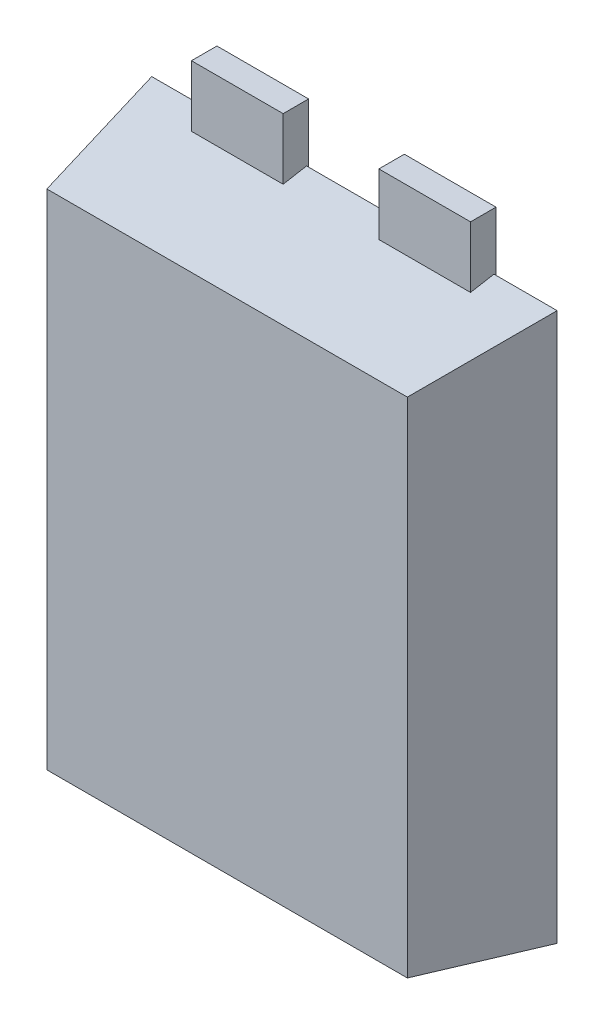
ISO-10303-21;
HEADER;
FILE_DESCRIPTION(('STEP AP214'),'2;1');
FILE_NAME('part.step','',(''),(''),'','','');
FILE_SCHEMA(('AUTOMOTIVE_DESIGN { 1 0 10303 214 1 1 1 1 }'));
ENDSEC;
DATA;
#1=APPLICATION_CONTEXT('core data for automotive mechanical design processes');
#2=APPLICATION_PROTOCOL_DEFINITION('international standard','automotive_design',2000,#1);
#3=PRODUCT_CONTEXT('',#1,'mechanical');
#4=PRODUCT('Part','Part','',(#3));
#5=PRODUCT_RELATED_PRODUCT_CATEGORY('part','',(#4));
#6=PRODUCT_DEFINITION_FORMATION('','',#4);
#7=PRODUCT_DEFINITION_CONTEXT('part definition',#1,'design');
#8=PRODUCT_DEFINITION('design','',#6,#7);
#9=PRODUCT_DEFINITION_SHAPE('','',#8);
#10=(LENGTH_UNIT() NAMED_UNIT(*) SI_UNIT(.MILLI.,.METRE.));
#11=(NAMED_UNIT(*) PLANE_ANGLE_UNIT() SI_UNIT($,.RADIAN.));
#12=(NAMED_UNIT(*) SI_UNIT($,.STERADIAN.) SOLID_ANGLE_UNIT());
#13=UNCERTAINTY_MEASURE_WITH_UNIT(LENGTH_MEASURE(1.E-05),#10,'distance_accuracy_value','');
#14=(GEOMETRIC_REPRESENTATION_CONTEXT(3) GLOBAL_UNCERTAINTY_ASSIGNED_CONTEXT((#13)) GLOBAL_UNIT_ASSIGNED_CONTEXT((#10,
#11,#12)) REPRESENTATION_CONTEXT('',''));
#15=CARTESIAN_POINT('',(0.,0.,0.));
#16=DIRECTION('',(0.,0.,1.));
#17=DIRECTION('',(1.,0.,0.));
#18=AXIS2_PLACEMENT_3D('',#15,#16,#17);
#19=CARTESIAN_POINT('',(0.47,3.25,0.25));
#20=DIRECTION('',(1.,0.,0.));
#21=DIRECTION('',(0.,1.,0.));
#22=AXIS2_PLACEMENT_3D('',#19,#20,#21);
#23=PLANE('',#22);
#24=DIRECTION('',(0.,-1.,0.));
#25=VECTOR('',#24,1.);
#26=CARTESIAN_POINT('',(0.47,3.25,0.));
#27=LINE('',#26,#25);
#28=CARTESIAN_POINT('',(0.47,3.25,0.));
#29=VERTEX_POINT('',#28);
#30=CARTESIAN_POINT('',(0.47,2.4,0.));
#31=VERTEX_POINT('',#30);
#32=EDGE_CURVE('E111',#29,#31,#27,.T.);
#33=ORIENTED_EDGE('',*,*,#32,.T.);
#34=DIRECTION('',(0.,0.,-1.));
#35=VECTOR('',#34,1.);
#36=CARTESIAN_POINT('',(0.47,2.4,0.25));
#37=LINE('',#36,#35);
#38=CARTESIAN_POINT('',(0.47,2.4,0.25));
#39=VERTEX_POINT('',#38);
#40=EDGE_CURVE('E12',#39,#31,#37,.T.);
#41=ORIENTED_EDGE('',*,*,#40,.F.);
#42=DIRECTION('',(0.,-1.,0.));
#43=VECTOR('',#42,1.);
#44=CARTESIAN_POINT('',(0.47,3.25,0.25));
#45=LINE('',#44,#43);
#46=CARTESIAN_POINT('',(0.47,3.25,0.25));
#47=VERTEX_POINT('',#46);
#48=EDGE_CURVE('E99',#47,#39,#45,.T.);
#49=ORIENTED_EDGE('',*,*,#48,.F.);
#50=DIRECTION('',(0.,0.,-1.));
#51=VECTOR('',#50,1.);
#52=CARTESIAN_POINT('',(0.47,3.25,0.25));
#53=LINE('',#52,#51);
#54=EDGE_CURVE('E107',#47,#29,#53,.T.);
#55=ORIENTED_EDGE('',*,*,#54,.T.);
#56=EDGE_LOOP('',(#33,#41,#49,#55));
#57=FACE_BOUND('',#56,.T.);
#58=ADVANCED_FACE('F48',(#57),#23,.F.);
#59=CARTESIAN_POINT('',(0.47,2.4,0.25));
#60=DIRECTION('',(0.,1.,0.));
#61=DIRECTION('',(0.,0.,1.));
#62=AXIS2_PLACEMENT_3D('',#59,#60,#61);
#63=PLANE('',#62);
#64=DIRECTION('',(1.,0.,0.));
#65=VECTOR('',#64,1.);
#66=CARTESIAN_POINT('',(0.47,2.4,0.));
#67=LINE('',#66,#65);
#68=CARTESIAN_POINT('',(1.37,2.4,0.));
#69=VERTEX_POINT('',#68);
#70=EDGE_CURVE('E103',#31,#69,#67,.T.);
#71=ORIENTED_EDGE('',*,*,#70,.T.);
#72=DIRECTION('',(0.,0.,-1.));
#73=VECTOR('',#72,1.);
#74=CARTESIAN_POINT('',(1.37,2.4,0.25));
#75=LINE('',#74,#73);
#76=CARTESIAN_POINT('',(1.37,2.4,0.25));
#77=VERTEX_POINT('',#76);
#78=EDGE_CURVE('E56',#77,#69,#75,.T.);
#79=ORIENTED_EDGE('',*,*,#78,.F.);
#80=DIRECTION('',(1.,0.,0.));
#81=VECTOR('',#80,1.);
#82=CARTESIAN_POINT('',(0.47,2.4,0.25));
#83=LINE('',#82,#81);
#84=EDGE_CURVE('E94',#39,#77,#83,.T.);
#85=ORIENTED_EDGE('',*,*,#84,.F.);
#86=ORIENTED_EDGE('',*,*,#40,.T.);
#87=EDGE_LOOP('',(#71,#79,#85,#86));
#88=FACE_BOUND('',#87,.T.);
#89=ADVANCED_FACE('F102',(#88),#63,.F.);
#90=CARTESIAN_POINT('',(1.37,3.25,0.25));
#91=DIRECTION('',(-1.,0.,0.));
#92=DIRECTION('',(0.,-1.,0.));
#93=AXIS2_PLACEMENT_3D('',#90,#91,#92);
#94=PLANE('',#93);
#95=DIRECTION('',(0.,1.,0.));
#96=VECTOR('',#95,1.);
#97=CARTESIAN_POINT('',(1.37,3.25,0.));
#98=LINE('',#97,#96);
#99=CARTESIAN_POINT('',(1.37,3.25,0.));
#100=VERTEX_POINT('',#99);
#101=EDGE_CURVE('E81',#69,#100,#98,.T.);
#102=ORIENTED_EDGE('',*,*,#101,.T.);
#103=DIRECTION('',(0.,0.,-1.));
#104=VECTOR('',#103,1.);
#105=CARTESIAN_POINT('',(1.37,3.25,0.25));
#106=LINE('',#105,#104);
#107=CARTESIAN_POINT('',(1.37,3.25,0.25));
#108=VERTEX_POINT('',#107);
#109=EDGE_CURVE('E104',#108,#100,#106,.T.);
#110=ORIENTED_EDGE('',*,*,#109,.F.);
#111=DIRECTION('',(0.,1.,0.));
#112=VECTOR('',#111,1.);
#113=CARTESIAN_POINT('',(1.37,3.25,0.25));
#114=LINE('',#113,#112);
#115=EDGE_CURVE('E97',#77,#108,#114,.T.);
#116=ORIENTED_EDGE('',*,*,#115,.F.);
#117=ORIENTED_EDGE('',*,*,#78,.T.);
#118=EDGE_LOOP('',(#102,#110,#116,#117));
#119=FACE_BOUND('',#118,.T.);
#120=ADVANCED_FACE('F105',(#119),#94,.F.);
#121=CARTESIAN_POINT('',(0.47,3.25,0.25));
#122=DIRECTION('',(0.,-1.,0.));
#123=DIRECTION('',(0.,0.,-1.));
#124=AXIS2_PLACEMENT_3D('',#121,#122,#123);
#125=PLANE('',#124);
#126=DIRECTION('',(-1.,0.,0.));
#127=VECTOR('',#126,1.);
#128=CARTESIAN_POINT('',(0.47,3.25,0.));
#129=LINE('',#128,#127);
#130=EDGE_CURVE('E87',#100,#29,#129,.T.);
#131=ORIENTED_EDGE('',*,*,#130,.T.);
#132=ORIENTED_EDGE('',*,*,#54,.F.);
#133=DIRECTION('',(-1.,0.,0.));
#134=VECTOR('',#133,1.);
#135=CARTESIAN_POINT('',(0.47,3.25,0.25));
#136=LINE('',#135,#134);
#137=EDGE_CURVE('E64',#108,#47,#136,.T.);
#138=ORIENTED_EDGE('',*,*,#137,.F.);
#139=ORIENTED_EDGE('',*,*,#109,.T.);
#140=EDGE_LOOP('',(#131,#132,#138,#139));
#141=FACE_BOUND('',#140,.T.);
#142=ADVANCED_FACE('F118',(#141),#125,.F.);
#143=CARTESIAN_POINT('',(0.,0.,0.25));
#144=DIRECTION('',(0.,0.,1.));
#145=DIRECTION('',(1.,0.,0.));
#146=AXIS2_PLACEMENT_3D('',#143,#144,#145);
#147=PLANE('',#146);
#148=ORIENTED_EDGE('',*,*,#48,.T.);
#149=ORIENTED_EDGE('',*,*,#84,.T.);
#150=ORIENTED_EDGE('',*,*,#115,.T.);
#151=ORIENTED_EDGE('',*,*,#137,.T.);
#152=EDGE_LOOP('',(#148,#149,#150,#151));
#153=FACE_BOUND('',#152,.T.);
#154=ADVANCED_FACE('F95',(#153),#147,.T.);
#155=CARTESIAN_POINT('',(0.,0.,0.));
#156=DIRECTION('',(0.,0.,1.));
#157=DIRECTION('',(1.,0.,0.));
#158=AXIS2_PLACEMENT_3D('',#155,#156,#157);
#159=PLANE('',#158);
#160=ORIENTED_EDGE('',*,*,#32,.F.);
#161=ORIENTED_EDGE('',*,*,#130,.F.);
#162=ORIENTED_EDGE('',*,*,#101,.F.);
#163=ORIENTED_EDGE('',*,*,#70,.F.);
#164=EDGE_LOOP('',(#160,#161,#162,#163));
#165=FACE_BOUND('',#164,.T.);
#166=ADVANCED_FACE('F121',(#165),#159,.F.);
#167=CLOSED_SHELL('',(#58,#89,#120,#142,#154,#166));
#168=MANIFOLD_SOLID_BREP('B2',#167);
#169=CARTESIAN_POINT('',(-1.37,3.25,0.25));
#170=DIRECTION('',(1.,0.,0.));
#171=DIRECTION('',(0.,0.,-1.));
#172=AXIS2_PLACEMENT_3D('',#169,#170,#171);
#173=PLANE('',#172);
#174=DIRECTION('',(0.,-1.,0.));
#175=VECTOR('',#174,1.);
#176=CARTESIAN_POINT('',(-1.37,3.25,0.));
#177=LINE('',#176,#175);
#178=CARTESIAN_POINT('',(-1.37,3.25,0.));
#179=VERTEX_POINT('',#178);
#180=CARTESIAN_POINT('',(-1.37,2.4,0.));
#181=VERTEX_POINT('',#180);
#182=EDGE_CURVE('E244',#179,#181,#177,.T.);
#183=ORIENTED_EDGE('',*,*,#182,.T.);
#184=DIRECTION('',(0.,0.,-1.));
#185=VECTOR('',#184,1.);
#186=CARTESIAN_POINT('',(-1.37,2.4,0.25));
#187=LINE('',#186,#185);
#188=CARTESIAN_POINT('',(-1.37,2.4,0.25));
#189=VERTEX_POINT('',#188);
#190=EDGE_CURVE('E46',#189,#181,#187,.T.);
#191=ORIENTED_EDGE('',*,*,#190,.F.);
#192=DIRECTION('',(0.,-1.,0.));
#193=VECTOR('',#192,1.);
#194=CARTESIAN_POINT('',(-1.37,3.25,0.25));
#195=LINE('',#194,#193);
#196=CARTESIAN_POINT('',(-1.37,3.25,0.25));
#197=VERTEX_POINT('',#196);
#198=EDGE_CURVE('E232',#197,#189,#195,.T.);
#199=ORIENTED_EDGE('',*,*,#198,.F.);
#200=DIRECTION('',(0.,0.,-1.));
#201=VECTOR('',#200,1.);
#202=CARTESIAN_POINT('',(-1.37,3.25,0.25));
#203=LINE('',#202,#201);
#204=EDGE_CURVE('E240',#197,#179,#203,.T.);
#205=ORIENTED_EDGE('',*,*,#204,.T.);
#206=EDGE_LOOP('',(#183,#191,#199,#205));
#207=FACE_BOUND('',#206,.T.);
#208=ADVANCED_FACE('F181',(#207),#173,.F.);
#209=CARTESIAN_POINT('',(-1.37,2.4,0.25));
#210=DIRECTION('',(0.,1.,0.));
#211=DIRECTION('',(0.,0.,1.));
#212=AXIS2_PLACEMENT_3D('',#209,#210,#211);
#213=PLANE('',#212);
#214=DIRECTION('',(1.,0.,0.));
#215=VECTOR('',#214,1.);
#216=CARTESIAN_POINT('',(-1.37,2.4,0.));
#217=LINE('',#216,#215);
#218=CARTESIAN_POINT('',(-0.47,2.4,0.));
#219=VERTEX_POINT('',#218);
#220=EDGE_CURVE('E236',#181,#219,#217,.T.);
#221=ORIENTED_EDGE('',*,*,#220,.T.);
#222=DIRECTION('',(0.,0.,-1.));
#223=VECTOR('',#222,1.);
#224=CARTESIAN_POINT('',(-0.47,2.4,0.25));
#225=LINE('',#224,#223);
#226=CARTESIAN_POINT('',(-0.47,2.4,0.25));
#227=VERTEX_POINT('',#226);
#228=EDGE_CURVE('E189',#227,#219,#225,.T.);
#229=ORIENTED_EDGE('',*,*,#228,.F.);
#230=DIRECTION('',(1.,0.,0.));
#231=VECTOR('',#230,1.);
#232=CARTESIAN_POINT('',(-1.37,2.4,0.25));
#233=LINE('',#232,#231);
#234=EDGE_CURVE('E227',#189,#227,#233,.T.);
#235=ORIENTED_EDGE('',*,*,#234,.F.);
#236=ORIENTED_EDGE('',*,*,#190,.T.);
#237=EDGE_LOOP('',(#221,#229,#235,#236));
#238=FACE_BOUND('',#237,.T.);
#239=ADVANCED_FACE('F235',(#238),#213,.F.);
#240=CARTESIAN_POINT('',(-0.47,3.25,0.25));
#241=DIRECTION('',(-1.,0.,0.));
#242=DIRECTION('',(0.,-1.,0.));
#243=AXIS2_PLACEMENT_3D('',#240,#241,#242);
#244=PLANE('',#243);
#245=DIRECTION('',(0.,1.,0.));
#246=VECTOR('',#245,1.);
#247=CARTESIAN_POINT('',(-0.47,3.25,0.));
#248=LINE('',#247,#246);
#249=CARTESIAN_POINT('',(-0.47,3.25,0.));
#250=VERTEX_POINT('',#249);
#251=EDGE_CURVE('E214',#219,#250,#248,.T.);
#252=ORIENTED_EDGE('',*,*,#251,.T.);
#253=DIRECTION('',(0.,0.,-1.));
#254=VECTOR('',#253,1.);
#255=CARTESIAN_POINT('',(-0.47,3.25,0.25));
#256=LINE('',#255,#254);
#257=CARTESIAN_POINT('',(-0.47,3.25,0.25));
#258=VERTEX_POINT('',#257);
#259=EDGE_CURVE('E237',#258,#250,#256,.T.);
#260=ORIENTED_EDGE('',*,*,#259,.F.);
#261=DIRECTION('',(0.,1.,0.));
#262=VECTOR('',#261,1.);
#263=CARTESIAN_POINT('',(-0.47,3.25,0.25));
#264=LINE('',#263,#262);
#265=EDGE_CURVE('E230',#227,#258,#264,.T.);
#266=ORIENTED_EDGE('',*,*,#265,.F.);
#267=ORIENTED_EDGE('',*,*,#228,.T.);
#268=EDGE_LOOP('',(#252,#260,#266,#267));
#269=FACE_BOUND('',#268,.T.);
#270=ADVANCED_FACE('F238',(#269),#244,.F.);
#271=CARTESIAN_POINT('',(-1.37,3.25,0.25));
#272=DIRECTION('',(0.,-1.,0.));
#273=DIRECTION('',(0.,0.,-1.));
#274=AXIS2_PLACEMENT_3D('',#271,#272,#273);
#275=PLANE('',#274);
#276=DIRECTION('',(-1.,0.,0.));
#277=VECTOR('',#276,1.);
#278=CARTESIAN_POINT('',(-1.37,3.25,0.));
#279=LINE('',#278,#277);
#280=EDGE_CURVE('E220',#250,#179,#279,.T.);
#281=ORIENTED_EDGE('',*,*,#280,.T.);
#282=ORIENTED_EDGE('',*,*,#204,.F.);
#283=DIRECTION('',(-1.,0.,0.));
#284=VECTOR('',#283,1.);
#285=CARTESIAN_POINT('',(-1.37,3.25,0.25));
#286=LINE('',#285,#284);
#287=EDGE_CURVE('E197',#258,#197,#286,.T.);
#288=ORIENTED_EDGE('',*,*,#287,.F.);
#289=ORIENTED_EDGE('',*,*,#259,.T.);
#290=EDGE_LOOP('',(#281,#282,#288,#289));
#291=FACE_BOUND('',#290,.T.);
#292=ADVANCED_FACE('F251',(#291),#275,.F.);
#293=CARTESIAN_POINT('',(0.,0.,0.25));
#294=DIRECTION('',(0.,0.,1.));
#295=DIRECTION('',(1.,0.,0.));
#296=AXIS2_PLACEMENT_3D('',#293,#294,#295);
#297=PLANE('',#296);
#298=ORIENTED_EDGE('',*,*,#198,.T.);
#299=ORIENTED_EDGE('',*,*,#234,.T.);
#300=ORIENTED_EDGE('',*,*,#265,.T.);
#301=ORIENTED_EDGE('',*,*,#287,.T.);
#302=EDGE_LOOP('',(#298,#299,#300,#301));
#303=FACE_BOUND('',#302,.T.);
#304=ADVANCED_FACE('F228',(#303),#297,.T.);
#305=CARTESIAN_POINT('',(0.,0.,0.));
#306=DIRECTION('',(0.,0.,1.));
#307=DIRECTION('',(1.,0.,0.));
#308=AXIS2_PLACEMENT_3D('',#305,#306,#307);
#309=PLANE('',#308);
#310=ORIENTED_EDGE('',*,*,#182,.F.);
#311=ORIENTED_EDGE('',*,*,#280,.F.);
#312=ORIENTED_EDGE('',*,*,#251,.F.);
#313=ORIENTED_EDGE('',*,*,#220,.F.);
#314=EDGE_LOOP('',(#310,#311,#312,#313));
#315=FACE_BOUND('',#314,.T.);
#316=ADVANCED_FACE('F254',(#315),#309,.F.);
#317=CLOSED_SHELL('',(#208,#239,#270,#292,#304,#316));
#318=MANIFOLD_SOLID_BREP('B6',#317);
#319=CARTESIAN_POINT('',(1.525,1.15,0.25));
#320=DIRECTION('',(0.,-1.,0.));
#321=DIRECTION('',(1.,0.,0.));
#322=AXIS2_PLACEMENT_3D('',#319,#320,#321);
#323=PLANE('',#322);
#324=DIRECTION('',(-1.,0.,0.));
#325=VECTOR('',#324,1.);
#326=CARTESIAN_POINT('',(1.525,1.15,0.02));
#327=LINE('',#326,#325);
#328=CARTESIAN_POINT('',(1.525,1.15,0.02));
#329=VERTEX_POINT('',#328);
#330=CARTESIAN_POINT('',(-1.525,1.15,0.02));
#331=VERTEX_POINT('',#330);
#332=EDGE_CURVE('E459',#329,#331,#327,.T.);
#333=ORIENTED_EDGE('',*,*,#332,.F.);
#334=DIRECTION('',(0.,0.,-1.));
#335=VECTOR('',#334,1.);
#336=CARTESIAN_POINT('',(1.525,1.15,0.25));
#337=LINE('',#336,#335);
#338=CARTESIAN_POINT('',(1.525,1.15,0.));
#339=VERTEX_POINT('',#338);
#340=EDGE_CURVE('E482',#329,#339,#337,.T.);
#341=ORIENTED_EDGE('',*,*,#340,.T.);
#342=DIRECTION('',(-1.,0.,0.));
#343=VECTOR('',#342,1.);
#344=CARTESIAN_POINT('',(1.525,1.15,0.));
#345=LINE('',#344,#343);
#346=CARTESIAN_POINT('',(-1.525,1.15,0.));
#347=VERTEX_POINT('',#346);
#348=EDGE_CURVE('E466',#339,#347,#345,.T.);
#349=ORIENTED_EDGE('',*,*,#348,.T.);
#350=DIRECTION('',(0.,0.,-1.));
#351=VECTOR('',#350,1.);
#352=CARTESIAN_POINT('',(-1.525,1.15,0.25));
#353=LINE('',#352,#351);
#354=EDGE_CURVE('E538',#331,#347,#353,.T.);
#355=ORIENTED_EDGE('',*,*,#354,.F.);
#356=EDGE_LOOP('',(#333,#341,#349,#355));
#357=FACE_BOUND('',#356,.T.);
#358=ADVANCED_FACE('F305',(#357),#323,.F.);
#359=CARTESIAN_POINT('',(-1.525,1.15,0.25));
#360=DIRECTION('',(1.,0.,0.));
#361=DIRECTION('',(0.,1.,0.));
#362=AXIS2_PLACEMENT_3D('',#359,#360,#361);
#363=PLANE('',#362);
#364=DIRECTION('',(0.,-1.,0.));
#365=VECTOR('',#364,1.);
#366=CARTESIAN_POINT('',(-1.525,1.15,0.02));
#367=LINE('',#366,#365);
#368=CARTESIAN_POINT('',(-1.525,-2.4,0.02));
#369=VERTEX_POINT('',#368);
#370=EDGE_CURVE('E461',#331,#369,#367,.T.);
#371=ORIENTED_EDGE('',*,*,#370,.F.);
#372=ORIENTED_EDGE('',*,*,#354,.T.);
#373=DIRECTION('',(0.,-1.,0.));
#374=VECTOR('',#373,1.);
#375=CARTESIAN_POINT('',(-1.525,1.15,0.));
#376=LINE('',#375,#374);
#377=CARTESIAN_POINT('',(-1.525,-2.4,0.));
#378=VERTEX_POINT('',#377);
#379=EDGE_CURVE('E485',#347,#378,#376,.T.);
#380=ORIENTED_EDGE('',*,*,#379,.T.);
#381=DIRECTION('',(0.,0.,-1.));
#382=VECTOR('',#381,1.);
#383=CARTESIAN_POINT('',(-1.525,-2.4,0.25));
#384=LINE('',#383,#382);
#385=EDGE_CURVE('E536',#369,#378,#384,.T.);
#386=ORIENTED_EDGE('',*,*,#385,.F.);
#387=EDGE_LOOP('',(#371,#372,#380,#386));
#388=FACE_BOUND('',#387,.T.);
#389=ADVANCED_FACE('F576',(#388),#363,.F.);
#390=CARTESIAN_POINT('',(-1.525,-2.4,0.25));
#391=DIRECTION('',(0.,1.,0.));
#392=DIRECTION('',(-1.,0.,0.));
#393=AXIS2_PLACEMENT_3D('',#390,#391,#392);
#394=PLANE('',#393);
#395=DIRECTION('',(1.,0.,0.));
#396=VECTOR('',#395,1.);
#397=CARTESIAN_POINT('',(-1.525,-2.4,0.02));
#398=LINE('',#397,#396);
#399=CARTESIAN_POINT('',(-0.9,-2.4,0.02));
#400=VERTEX_POINT('',#399);
#401=EDGE_CURVE('E463',#369,#400,#398,.T.);
#402=ORIENTED_EDGE('',*,*,#401,.F.);
#403=ORIENTED_EDGE('',*,*,#385,.T.);
#404=DIRECTION('',(1.,0.,0.));
#405=VECTOR('',#404,1.);
#406=CARTESIAN_POINT('',(-1.525,-2.4,0.));
#407=LINE('',#406,#405);
#408=CARTESIAN_POINT('',(-0.9,-2.4,0.));
#409=VERTEX_POINT('',#408);
#410=EDGE_CURVE('E488',#378,#409,#407,.T.);
#411=ORIENTED_EDGE('',*,*,#410,.T.);
#412=DIRECTION('',(0.,0.,-1.));
#413=VECTOR('',#412,1.);
#414=CARTESIAN_POINT('',(-0.9,-2.4,0.25));
#415=LINE('',#414,#413);
#416=EDGE_CURVE('E534',#400,#409,#415,.T.);
#417=ORIENTED_EDGE('',*,*,#416,.F.);
#418=EDGE_LOOP('',(#402,#403,#411,#417));
#419=FACE_BOUND('',#418,.T.);
#420=ADVANCED_FACE('F582',(#419),#394,.F.);
#421=CARTESIAN_POINT('',(-0.9,-2.4,0.25));
#422=DIRECTION('',(1.,0.,0.));
#423=DIRECTION('',(0.,0.,-1.));
#424=AXIS2_PLACEMENT_3D('',#421,#422,#423);
#425=PLANE('',#424);
#426=DIRECTION('',(0.,-1.,0.));
#427=VECTOR('',#426,1.);
#428=CARTESIAN_POINT('',(-0.9,-2.4,0.25));
#429=LINE('',#428,#427);
#430=CARTESIAN_POINT('',(-0.9,-2.64944479443705,0.25));
#431=VERTEX_POINT('',#430);
#432=CARTESIAN_POINT('',(-0.9,-3.25,0.25));
#433=VERTEX_POINT('',#432);
#434=EDGE_CURVE('E467',#431,#433,#429,.T.);
#435=ORIENTED_EDGE('',*,*,#434,.F.);
#436=DIRECTION('',(0.,-0.173648177666937,-0.984807753012207));
#437=VECTOR('',#436,1.);
#438=CARTESIAN_POINT('',(-0.9,-2.6419231135315,0.292657572172603));
#439=LINE('',#438,#437);
#440=CARTESIAN_POINT('',(-0.9,-2.69,0.02));
#441=VERTEX_POINT('',#440);
#442=EDGE_CURVE('E549',#431,#441,#439,.T.);
#443=ORIENTED_EDGE('',*,*,#442,.T.);
#444=DIRECTION('',(0.,-1.,0.));
#445=VECTOR('',#444,1.);
#446=CARTESIAN_POINT('',(-0.9,-2.4,0.02));
#447=LINE('',#446,#445);
#448=EDGE_CURVE('E443',#400,#441,#447,.T.);
#449=ORIENTED_EDGE('',*,*,#448,.F.);
#450=ORIENTED_EDGE('',*,*,#416,.T.);
#451=DIRECTION('',(0.,-1.,0.));
#452=VECTOR('',#451,1.);
#453=CARTESIAN_POINT('',(-0.9,-2.4,0.));
#454=LINE('',#453,#452);
#455=CARTESIAN_POINT('',(-0.9,-3.25,0.));
#456=VERTEX_POINT('',#455);
#457=EDGE_CURVE('E491',#409,#456,#454,.T.);
#458=ORIENTED_EDGE('',*,*,#457,.T.);
#459=DIRECTION('',(0.,0.,-1.));
#460=VECTOR('',#459,1.);
#461=CARTESIAN_POINT('',(-0.9,-3.25,0.25));
#462=LINE('',#461,#460);
#463=EDGE_CURVE('E531',#433,#456,#462,.T.);
#464=ORIENTED_EDGE('',*,*,#463,.F.);
#465=EDGE_LOOP('',(#435,#443,#449,#450,#458,#464));
#466=FACE_BOUND('',#465,.T.);
#467=ADVANCED_FACE('F651',(#466),#425,.F.);
#468=CARTESIAN_POINT('',(0.9,-3.25,0.25));
#469=DIRECTION('',(-1.,0.,0.));
#470=DIRECTION('',(0.,0.,1.));
#471=AXIS2_PLACEMENT_3D('',#468,#469,#470);
#472=PLANE('',#471);
#473=DIRECTION('',(0.,1.,0.));
#474=VECTOR('',#473,1.);
#475=CARTESIAN_POINT('',(0.9,-3.25,0.02));
#476=LINE('',#475,#474);
#477=CARTESIAN_POINT('',(0.9,-2.69,0.02));
#478=VERTEX_POINT('',#477);
#479=CARTESIAN_POINT('',(0.9,-2.4,0.02));
#480=VERTEX_POINT('',#479);
#481=EDGE_CURVE('E457',#478,#480,#476,.T.);
#482=ORIENTED_EDGE('',*,*,#481,.F.);
#483=DIRECTION('',(0.,0.173648177666937,0.984807753012207));
#484=VECTOR('',#483,1.);
#485=CARTESIAN_POINT('',(0.9,-2.66755374969749,0.147299011259188));
#486=LINE('',#485,#484);
#487=CARTESIAN_POINT('',(0.9,-2.64944479443705,0.25));
#488=VERTEX_POINT('',#487);
#489=EDGE_CURVE('E543',#478,#488,#486,.T.);
#490=ORIENTED_EDGE('',*,*,#489,.T.);
#491=DIRECTION('',(0.,1.,0.));
#492=VECTOR('',#491,1.);
#493=CARTESIAN_POINT('',(0.9,-3.25,0.25));
#494=LINE('',#493,#492);
#495=CARTESIAN_POINT('',(0.9,-3.25,0.25));
#496=VERTEX_POINT('',#495);
#497=EDGE_CURVE('E480',#496,#488,#494,.T.);
#498=ORIENTED_EDGE('',*,*,#497,.F.);
#499=DIRECTION('',(0.,0.,-1.));
#500=VECTOR('',#499,1.);
#501=CARTESIAN_POINT('',(0.9,-3.25,0.25));
#502=LINE('',#501,#500);
#503=CARTESIAN_POINT('',(0.9,-3.25,0.));
#504=VERTEX_POINT('',#503);
#505=EDGE_CURVE('E516',#496,#504,#502,.T.);
#506=ORIENTED_EDGE('',*,*,#505,.T.);
#507=DIRECTION('',(0.,1.,0.));
#508=VECTOR('',#507,1.);
#509=CARTESIAN_POINT('',(0.9,-3.25,0.));
#510=LINE('',#509,#508);
#511=CARTESIAN_POINT('',(0.9,-2.4,0.));
#512=VERTEX_POINT('',#511);
#513=EDGE_CURVE('E503',#504,#512,#510,.T.);
#514=ORIENTED_EDGE('',*,*,#513,.T.);
#515=DIRECTION('',(0.,0.,-1.));
#516=VECTOR('',#515,1.);
#517=CARTESIAN_POINT('',(0.9,-2.4,0.25));
#518=LINE('',#517,#516);
#519=EDGE_CURVE('E514',#480,#512,#518,.T.);
#520=ORIENTED_EDGE('',*,*,#519,.F.);
#521=EDGE_LOOP('',(#482,#490,#498,#506,#514,#520));
#522=FACE_BOUND('',#521,.T.);
#523=ADVANCED_FACE('F645',(#522),#472,.F.);
#524=CARTESIAN_POINT('',(0.9,-2.4,0.25));
#525=DIRECTION('',(0.,1.,0.));
#526=DIRECTION('',(-1.,0.,0.));
#527=AXIS2_PLACEMENT_3D('',#524,#525,#526);
#528=PLANE('',#527);
#529=DIRECTION('',(1.,0.,0.));
#530=VECTOR('',#529,1.);
#531=CARTESIAN_POINT('',(0.9,-2.4,0.02));
#532=LINE('',#531,#530);
#533=CARTESIAN_POINT('',(1.525,-2.4,0.02));
#534=VERTEX_POINT('',#533);
#535=EDGE_CURVE('E455',#480,#534,#532,.T.);
#536=ORIENTED_EDGE('',*,*,#535,.F.);
#537=ORIENTED_EDGE('',*,*,#519,.T.);
#538=DIRECTION('',(1.,0.,0.));
#539=VECTOR('',#538,1.);
#540=CARTESIAN_POINT('',(0.9,-2.4,0.));
#541=LINE('',#540,#539);
#542=CARTESIAN_POINT('',(1.525,-2.4,0.));
#543=VERTEX_POINT('',#542);
#544=EDGE_CURVE('E506',#512,#543,#541,.T.);
#545=ORIENTED_EDGE('',*,*,#544,.T.);
#546=DIRECTION('',(0.,0.,-1.));
#547=VECTOR('',#546,1.);
#548=CARTESIAN_POINT('',(1.525,-2.4,0.25));
#549=LINE('',#548,#547);
#550=EDGE_CURVE('E512',#534,#543,#549,.T.);
#551=ORIENTED_EDGE('',*,*,#550,.F.);
#552=EDGE_LOOP('',(#536,#537,#545,#551));
#553=FACE_BOUND('',#552,.T.);
#554=ADVANCED_FACE('F650',(#553),#528,.F.);
#555=CARTESIAN_POINT('',(1.525,-2.4,0.25));
#556=DIRECTION('',(-1.,0.,0.));
#557=DIRECTION('',(0.,-1.,0.));
#558=AXIS2_PLACEMENT_3D('',#555,#556,#557);
#559=PLANE('',#558);
#560=DIRECTION('',(0.,1.,0.));
#561=VECTOR('',#560,1.);
#562=CARTESIAN_POINT('',(1.525,-2.4,0.02));
#563=LINE('',#562,#561);
#564=EDGE_CURVE('E540',#534,#329,#563,.T.);
#565=ORIENTED_EDGE('',*,*,#564,.F.);
#566=ORIENTED_EDGE('',*,*,#550,.T.);
#567=DIRECTION('',(0.,1.,0.));
#568=VECTOR('',#567,1.);
#569=CARTESIAN_POINT('',(1.525,-2.4,0.));
#570=LINE('',#569,#568);
#571=EDGE_CURVE('E470',#543,#339,#570,.T.);
#572=ORIENTED_EDGE('',*,*,#571,.T.);
#573=ORIENTED_EDGE('',*,*,#340,.F.);
#574=EDGE_LOOP('',(#565,#566,#572,#573));
#575=FACE_BOUND('',#574,.T.);
#576=ADVANCED_FACE('F635',(#575),#559,.F.);
#577=CARTESIAN_POINT('',(0.,0.,0.25));
#578=DIRECTION('',(0.,0.,1.));
#579=DIRECTION('',(1.,0.,0.));
#580=AXIS2_PLACEMENT_3D('',#577,#578,#579);
#581=PLANE('',#580);
#582=ORIENTED_EDGE('',*,*,#497,.T.);
#583=DIRECTION('',(-1.,0.,0.));
#584=VECTOR('',#583,1.);
#585=CARTESIAN_POINT('',(0.,-2.64944479443705,0.25));
#586=LINE('',#585,#584);
#587=EDGE_CURVE('E546',#488,#431,#586,.T.);
#588=ORIENTED_EDGE('',*,*,#587,.T.);
#589=ORIENTED_EDGE('',*,*,#434,.T.);
#590=DIRECTION('',(1.,0.,0.));
#591=VECTOR('',#590,1.);
#592=CARTESIAN_POINT('',(-0.9,-3.25,0.25));
#593=LINE('',#592,#591);
#594=CARTESIAN_POINT('',(-0.55,-3.25,0.25));
#595=VERTEX_POINT('',#594);
#596=EDGE_CURVE('E469',#433,#595,#593,.T.);
#597=ORIENTED_EDGE('',*,*,#596,.T.);
#598=DIRECTION('',(0.,1.,0.));
#599=VECTOR('',#598,1.);
#600=CARTESIAN_POINT('',(-0.55,-3.25,0.25));
#601=LINE('',#600,#599);
#602=CARTESIAN_POINT('',(-0.55,-3.05,0.25));
#603=VERTEX_POINT('',#602);
#604=EDGE_CURVE('E472',#595,#603,#601,.T.);
#605=ORIENTED_EDGE('',*,*,#604,.T.);
#606=DIRECTION('',(1.,0.,0.));
#607=VECTOR('',#606,1.);
#608=CARTESIAN_POINT('',(-0.55,-3.05,0.25));
#609=LINE('',#608,#607);
#610=CARTESIAN_POINT('',(0.55,-3.05,0.25));
#611=VERTEX_POINT('',#610);
#612=EDGE_CURVE('E474',#603,#611,#609,.T.);
#613=ORIENTED_EDGE('',*,*,#612,.T.);
#614=DIRECTION('',(0.,-1.,0.));
#615=VECTOR('',#614,1.);
#616=CARTESIAN_POINT('',(0.55,-3.05,0.25));
#617=LINE('',#616,#615);
#618=CARTESIAN_POINT('',(0.55,-3.25,0.25));
#619=VERTEX_POINT('',#618);
#620=EDGE_CURVE('E476',#611,#619,#617,.T.);
#621=ORIENTED_EDGE('',*,*,#620,.T.);
#622=DIRECTION('',(1.,0.,0.));
#623=VECTOR('',#622,1.);
#624=CARTESIAN_POINT('',(0.55,-3.25,0.25));
#625=LINE('',#624,#623);
#626=EDGE_CURVE('E478',#619,#496,#625,.T.);
#627=ORIENTED_EDGE('',*,*,#626,.T.);
#628=EDGE_LOOP('',(#582,#588,#589,#597,#605,#613,#621,#627));
#629=FACE_BOUND('',#628,.T.);
#630=ADVANCED_FACE('F629',(#629),#581,.T.);
#631=CARTESIAN_POINT('',(-0.9,-3.25,0.25));
#632=DIRECTION('',(0.,1.,0.));
#633=DIRECTION('',(0.,0.,1.));
#634=AXIS2_PLACEMENT_3D('',#631,#632,#633);
#635=PLANE('',#634);
#636=DIRECTION('',(1.,0.,0.));
#637=VECTOR('',#636,1.);
#638=CARTESIAN_POINT('',(-0.9,-3.25,0.));
#639=LINE('',#638,#637);
#640=CARTESIAN_POINT('',(-0.55,-3.25,0.));
#641=VERTEX_POINT('',#640);
#642=EDGE_CURVE('E493',#456,#641,#639,.T.);
#643=ORIENTED_EDGE('',*,*,#642,.T.);
#644=DIRECTION('',(0.,0.,-1.));
#645=VECTOR('',#644,1.);
#646=CARTESIAN_POINT('',(-0.55,-3.25,0.25));
#647=LINE('',#646,#645);
#648=EDGE_CURVE('E528',#595,#641,#647,.T.);
#649=ORIENTED_EDGE('',*,*,#648,.F.);
#650=ORIENTED_EDGE('',*,*,#596,.F.);
#651=ORIENTED_EDGE('',*,*,#463,.T.);
#652=EDGE_LOOP('',(#643,#649,#650,#651));
#653=FACE_BOUND('',#652,.T.);
#654=ADVANCED_FACE('F634',(#653),#635,.F.);
#655=CARTESIAN_POINT('',(-0.55,-3.25,0.25));
#656=DIRECTION('',(-1.,0.,0.));
#657=DIRECTION('',(0.,0.,1.));
#658=AXIS2_PLACEMENT_3D('',#655,#656,#657);
#659=PLANE('',#658);
#660=DIRECTION('',(0.,1.,0.));
#661=VECTOR('',#660,1.);
#662=CARTESIAN_POINT('',(-0.55,-3.25,0.));
#663=LINE('',#662,#661);
#664=CARTESIAN_POINT('',(-0.55,-3.05,0.));
#665=VERTEX_POINT('',#664);
#666=EDGE_CURVE('E495',#641,#665,#663,.T.);
#667=ORIENTED_EDGE('',*,*,#666,.T.);
#668=DIRECTION('',(0.,0.,-1.));
#669=VECTOR('',#668,1.);
#670=CARTESIAN_POINT('',(-0.55,-3.05,0.25));
#671=LINE('',#670,#669);
#672=EDGE_CURVE('E525',#603,#665,#671,.T.);
#673=ORIENTED_EDGE('',*,*,#672,.F.);
#674=ORIENTED_EDGE('',*,*,#604,.F.);
#675=ORIENTED_EDGE('',*,*,#648,.T.);
#676=EDGE_LOOP('',(#667,#673,#674,#675));
#677=FACE_BOUND('',#676,.T.);
#678=ADVANCED_FACE('F732',(#677),#659,.F.);
#679=CARTESIAN_POINT('',(-0.55,-3.05,0.25));
#680=DIRECTION('',(0.,1.,0.));
#681=DIRECTION('',(0.,0.,1.));
#682=AXIS2_PLACEMENT_3D('',#679,#680,#681);
#683=PLANE('',#682);
#684=DIRECTION('',(1.,0.,0.));
#685=VECTOR('',#684,1.);
#686=CARTESIAN_POINT('',(-0.55,-3.05,0.));
#687=LINE('',#686,#685);
#688=CARTESIAN_POINT('',(0.55,-3.05,0.));
#689=VERTEX_POINT('',#688);
#690=EDGE_CURVE('E497',#665,#689,#687,.T.);
#691=ORIENTED_EDGE('',*,*,#690,.T.);
#692=DIRECTION('',(0.,0.,-1.));
#693=VECTOR('',#692,1.);
#694=CARTESIAN_POINT('',(0.55,-3.05,0.25));
#695=LINE('',#694,#693);
#696=EDGE_CURVE('E522',#611,#689,#695,.T.);
#697=ORIENTED_EDGE('',*,*,#696,.F.);
#698=ORIENTED_EDGE('',*,*,#612,.F.);
#699=ORIENTED_EDGE('',*,*,#672,.T.);
#700=EDGE_LOOP('',(#691,#697,#698,#699));
#701=FACE_BOUND('',#700,.T.);
#702=ADVANCED_FACE('F722',(#701),#683,.F.);
#703=CARTESIAN_POINT('',(0.55,-3.05,0.25));
#704=DIRECTION('',(1.,0.,0.));
#705=DIRECTION('',(0.,0.,-1.));
#706=AXIS2_PLACEMENT_3D('',#703,#704,#705);
#707=PLANE('',#706);
#708=DIRECTION('',(0.,-1.,0.));
#709=VECTOR('',#708,1.);
#710=CARTESIAN_POINT('',(0.55,-3.05,0.));
#711=LINE('',#710,#709);
#712=CARTESIAN_POINT('',(0.55,-3.25,0.));
#713=VERTEX_POINT('',#712);
#714=EDGE_CURVE('E499',#689,#713,#711,.T.);
#715=ORIENTED_EDGE('',*,*,#714,.T.);
#716=DIRECTION('',(0.,0.,-1.));
#717=VECTOR('',#716,1.);
#718=CARTESIAN_POINT('',(0.55,-3.25,0.25));
#719=LINE('',#718,#717);
#720=EDGE_CURVE('E519',#619,#713,#719,.T.);
#721=ORIENTED_EDGE('',*,*,#720,.F.);
#722=ORIENTED_EDGE('',*,*,#620,.F.);
#723=ORIENTED_EDGE('',*,*,#696,.T.);
#724=EDGE_LOOP('',(#715,#721,#722,#723));
#725=FACE_BOUND('',#724,.T.);
#726=ADVANCED_FACE('F712',(#725),#707,.F.);
#727=CARTESIAN_POINT('',(0.55,-3.25,0.25));
#728=DIRECTION('',(0.,1.,0.));
#729=DIRECTION('',(0.,0.,1.));
#730=AXIS2_PLACEMENT_3D('',#727,#728,#729);
#731=PLANE('',#730);
#732=DIRECTION('',(1.,0.,0.));
#733=VECTOR('',#732,1.);
#734=CARTESIAN_POINT('',(0.55,-3.25,0.));
#735=LINE('',#734,#733);
#736=EDGE_CURVE('E501',#713,#504,#735,.T.);
#737=ORIENTED_EDGE('',*,*,#736,.T.);
#738=ORIENTED_EDGE('',*,*,#505,.F.);
#739=ORIENTED_EDGE('',*,*,#626,.F.);
#740=ORIENTED_EDGE('',*,*,#720,.T.);
#741=EDGE_LOOP('',(#737,#738,#739,#740));
#742=FACE_BOUND('',#741,.T.);
#743=ADVANCED_FACE('F702',(#742),#731,.F.);
#744=CARTESIAN_POINT('',(0.,0.,0.));
#745=DIRECTION('',(0.,0.,1.));
#746=DIRECTION('',(1.,0.,0.));
#747=AXIS2_PLACEMENT_3D('',#744,#745,#746);
#748=PLANE('',#747);
#749=ORIENTED_EDGE('',*,*,#348,.F.);
#750=ORIENTED_EDGE('',*,*,#571,.F.);
#751=ORIENTED_EDGE('',*,*,#544,.F.);
#752=ORIENTED_EDGE('',*,*,#513,.F.);
#753=ORIENTED_EDGE('',*,*,#736,.F.);
#754=ORIENTED_EDGE('',*,*,#714,.F.);
#755=ORIENTED_EDGE('',*,*,#690,.F.);
#756=ORIENTED_EDGE('',*,*,#666,.F.);
#757=ORIENTED_EDGE('',*,*,#642,.F.);
#758=ORIENTED_EDGE('',*,*,#457,.F.);
#759=ORIENTED_EDGE('',*,*,#410,.F.);
#760=ORIENTED_EDGE('',*,*,#379,.F.);
#761=EDGE_LOOP('',(#749,#750,#751,#752,#753,#754,#755,#756,#757,#758,#759,#760));
#762=FACE_BOUND('',#761,.T.);
#763=ADVANCED_FACE('F573',(#762),#748,.F.);
#764=CARTESIAN_POINT('',(0.,0.,0.02));
#765=DIRECTION('',(0.,0.,1.));
#766=DIRECTION('',(1.,0.,0.));
#767=AXIS2_PLACEMENT_3D('',#764,#765,#766);
#768=PLANE('',#767);
#769=ORIENTED_EDGE('',*,*,#401,.T.);
#770=ORIENTED_EDGE('',*,*,#448,.T.);
#771=DIRECTION('',(1.,0.,0.));
#772=VECTOR('',#771,1.);
#773=CARTESIAN_POINT('',(-1.99,-2.69,0.02));
#774=LINE('',#773,#772);
#775=CARTESIAN_POINT('',(-1.99,-2.69,0.02));
#776=VERTEX_POINT('',#775);
#777=EDGE_CURVE('E433',#776,#441,#774,.T.);
#778=ORIENTED_EDGE('',*,*,#777,.F.);
#779=DIRECTION('',(0.,-1.,0.));
#780=VECTOR('',#779,1.);
#781=CARTESIAN_POINT('',(-1.99,2.69,0.02));
#782=LINE('',#781,#780);
#783=CARTESIAN_POINT('',(-1.99,2.69,0.02));
#784=VERTEX_POINT('',#783);
#785=EDGE_CURVE('E440',#784,#776,#782,.T.);
#786=ORIENTED_EDGE('',*,*,#785,.F.);
#787=DIRECTION('',(-1.,0.,0.));
#788=VECTOR('',#787,1.);
#789=CARTESIAN_POINT('',(-1.99,2.69,0.02));
#790=LINE('',#789,#788);
#791=CARTESIAN_POINT('',(1.99,2.69,0.02));
#792=VERTEX_POINT('',#791);
#793=EDGE_CURVE('E453',#792,#784,#790,.T.);
#794=ORIENTED_EDGE('',*,*,#793,.F.);
#795=DIRECTION('',(0.,1.,0.));
#796=VECTOR('',#795,1.);
#797=CARTESIAN_POINT('',(1.99,2.69,0.02));
#798=LINE('',#797,#796);
#799=CARTESIAN_POINT('',(1.99,-2.69,0.02));
#800=VERTEX_POINT('',#799);
#801=EDGE_CURVE('E444',#800,#792,#798,.T.);
#802=ORIENTED_EDGE('',*,*,#801,.F.);
#803=EDGE_CURVE('E445',#478,#800,#774,.T.);
#804=ORIENTED_EDGE('',*,*,#803,.F.);
#805=ORIENTED_EDGE('',*,*,#481,.T.);
#806=ORIENTED_EDGE('',*,*,#535,.T.);
#807=ORIENTED_EDGE('',*,*,#564,.T.);
#808=ORIENTED_EDGE('',*,*,#332,.T.);
#809=ORIENTED_EDGE('',*,*,#370,.T.);
#810=EDGE_LOOP('',(#769,#770,#778,#786,#794,#802,#804,#805,#806,#807,#808,#809));
#811=FACE_BOUND('',#810,.T.);
#812=ADVANCED_FACE('F438',(#811),#768,.F.);
#813=CARTESIAN_POINT('',(0.,0.,1.27));
#814=DIRECTION('',(0.,0.,1.));
#815=DIRECTION('',(1.,0.,0.));
#816=AXIS2_PLACEMENT_3D('',#813,#814,#815);
#817=PLANE('',#816);
#818=DIRECTION('',(-1.,0.,0.));
#819=VECTOR('',#818,1.);
#820=CARTESIAN_POINT('',(-1.99,2.46959127411442,1.27));
#821=LINE('',#820,#819);
#822=CARTESIAN_POINT('',(1.76959127411442,2.46959127411442,1.27));
#823=VERTEX_POINT('',#822);
#824=CARTESIAN_POINT('',(-1.76959127411442,2.46959127411442,1.27));
#825=VERTEX_POINT('',#824);
#826=EDGE_CURVE('E551',#823,#825,#821,.T.);
#827=ORIENTED_EDGE('',*,*,#826,.T.);
#828=DIRECTION('',(0.,-1.,0.));
#829=VECTOR('',#828,1.);
#830=CARTESIAN_POINT('',(-1.76959127411442,-2.46959127411441,1.27));
#831=LINE('',#830,#829);
#832=CARTESIAN_POINT('',(-1.76959127411442,-2.46959127411441,1.27));
#833=VERTEX_POINT('',#832);
#834=EDGE_CURVE('E557',#825,#833,#831,.T.);
#835=ORIENTED_EDGE('',*,*,#834,.T.);
#836=DIRECTION('',(1.,0.,0.));
#837=VECTOR('',#836,1.);
#838=CARTESIAN_POINT('',(1.99,-2.46959127411441,1.27));
#839=LINE('',#838,#837);
#840=CARTESIAN_POINT('',(1.76959127411442,-2.46959127411441,1.27));
#841=VERTEX_POINT('',#840);
#842=EDGE_CURVE('E434',#833,#841,#839,.T.);
#843=ORIENTED_EDGE('',*,*,#842,.T.);
#844=DIRECTION('',(0.,1.,0.));
#845=VECTOR('',#844,1.);
#846=CARTESIAN_POINT('',(1.76959127411442,2.46959127411442,1.27));
#847=LINE('',#846,#845);
#848=EDGE_CURVE('E554',#841,#823,#847,.T.);
#849=ORIENTED_EDGE('',*,*,#848,.T.);
#850=EDGE_LOOP('',(#827,#835,#843,#849));
#851=FACE_BOUND('',#850,.T.);
#852=ADVANCED_FACE('F565',(#851),#817,.T.);
#853=CARTESIAN_POINT('',(0.,-2.46959127411441,1.27));
#854=DIRECTION('',(0.,-0.984807753012207,0.173648177666937));
#855=DIRECTION('',(-1.,0.,0.));
#856=AXIS2_PLACEMENT_3D('',#853,#854,#855);
#857=PLANE('',#856);
#858=ORIENTED_EDGE('',*,*,#842,.F.);
#859=DIRECTION('',(-0.171087869746032,-0.171087869746042,-0.970287525247813));
#860=VECTOR('',#859,1.);
#861=CARTESIAN_POINT('',(-1.71779346321561,-2.41779346321559,1.56375998324644));
#862=LINE('',#861,#860);
#863=EDGE_CURVE('E328',#833,#776,#862,.T.);
#864=ORIENTED_EDGE('',*,*,#863,.T.);
#865=ORIENTED_EDGE('',*,*,#777,.T.);
#866=ORIENTED_EDGE('',*,*,#442,.F.);
#867=ORIENTED_EDGE('',*,*,#587,.F.);
#868=ORIENTED_EDGE('',*,*,#489,.F.);
#869=ORIENTED_EDGE('',*,*,#803,.T.);
#870=DIRECTION('',(-0.171087869746032,0.171087869746042,0.970287525247813));
#871=VECTOR('',#870,1.);
#872=CARTESIAN_POINT('',(1.71779346321561,-2.41779346321559,1.56375998324644));
#873=LINE('',#872,#871);
#874=EDGE_CURVE('E320',#800,#841,#873,.T.);
#875=ORIENTED_EDGE('',*,*,#874,.T.);
#876=EDGE_LOOP('',(#858,#864,#865,#866,#867,#868,#869,#875));
#877=FACE_BOUND('',#876,.T.);
#878=ADVANCED_FACE('F431',(#877),#857,.T.);
#879=CARTESIAN_POINT('',(0.,2.46959127411442,1.27));
#880=DIRECTION('',(0.,0.984807753012209,0.173648177666927));
#881=DIRECTION('',(1.,0.,0.));
#882=AXIS2_PLACEMENT_3D('',#879,#880,#881);
#883=PLANE('',#882);
#884=ORIENTED_EDGE('',*,*,#793,.T.);
#885=DIRECTION('',(0.171087869746032,-0.171087869746032,0.970287525247815));
#886=VECTOR('',#885,1.);
#887=CARTESIAN_POINT('',(-1.7177934632156,2.41779346321561,1.56375998324644));
#888=LINE('',#887,#886);
#889=EDGE_CURVE('E179',#784,#825,#888,.T.);
#890=ORIENTED_EDGE('',*,*,#889,.T.);
#891=ORIENTED_EDGE('',*,*,#826,.F.);
#892=DIRECTION('',(0.171087869746032,0.171087869746032,-0.970287525247815));
#893=VECTOR('',#892,1.);
#894=CARTESIAN_POINT('',(1.7177934632156,2.41779346321561,1.56375998324644));
#895=LINE('',#894,#893);
#896=EDGE_CURVE('E313',#823,#792,#895,.T.);
#897=ORIENTED_EDGE('',*,*,#896,.T.);
#898=EDGE_LOOP('',(#884,#890,#891,#897));
#899=FACE_BOUND('',#898,.T.);
#900=ADVANCED_FACE('F561',(#899),#883,.T.);
#901=CARTESIAN_POINT('',(-1.76959127411442,0.,1.27));
#902=DIRECTION('',(-0.984807753012209,0.,0.173648177666927));
#903=DIRECTION('',(0.,1.,0.));
#904=AXIS2_PLACEMENT_3D('',#901,#902,#903);
#905=PLANE('',#904);
#906=ORIENTED_EDGE('',*,*,#889,.F.);
#907=ORIENTED_EDGE('',*,*,#785,.T.);
#908=ORIENTED_EDGE('',*,*,#863,.F.);
#909=ORIENTED_EDGE('',*,*,#834,.F.);
#910=EDGE_LOOP('',(#906,#907,#908,#909));
#911=FACE_BOUND('',#910,.T.);
#912=ADVANCED_FACE('F448',(#911),#905,.T.);
#913=CARTESIAN_POINT('',(1.76959127411442,0.,1.27));
#914=DIRECTION('',(0.984807753012209,0.,0.173648177666927));
#915=DIRECTION('',(0.,-1.,0.));
#916=AXIS2_PLACEMENT_3D('',#913,#914,#915);
#917=PLANE('',#916);
#918=ORIENTED_EDGE('',*,*,#874,.F.);
#919=ORIENTED_EDGE('',*,*,#801,.T.);
#920=ORIENTED_EDGE('',*,*,#896,.F.);
#921=ORIENTED_EDGE('',*,*,#848,.F.);
#922=EDGE_LOOP('',(#918,#919,#920,#921));
#923=FACE_BOUND('',#922,.T.);
#924=ADVANCED_FACE('F307',(#923),#917,.T.);
#925=CLOSED_SHELL('',(#358,#389,#420,#467,#523,#554,#576,#630,#654,#678,#702,#726,#743,#763,
#812,#852,#878,#900,#912,#924));
#926=MANIFOLD_SOLID_BREP('B40',#925);
#927=ADVANCED_BREP_SHAPE_REPRESENTATION('',(#18,#168,#318,#926),#14);
#928=SHAPE_DEFINITION_REPRESENTATION(#9,#927);
ENDSEC;
END-ISO-10303-21;
